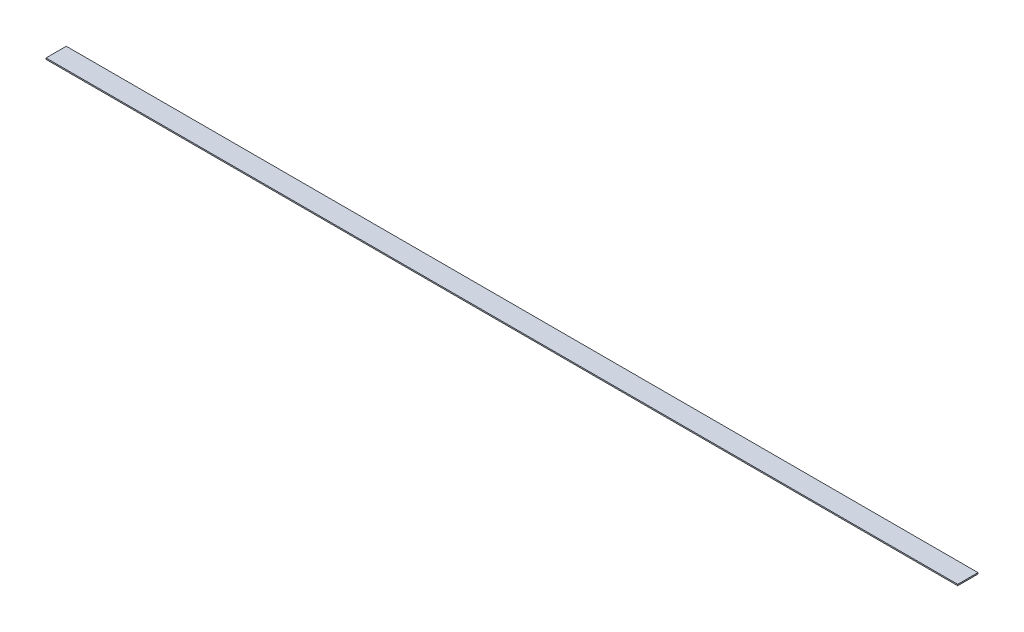
ISO-10303-21;
HEADER;
FILE_DESCRIPTION(('STEP AP214'),'2;1');
FILE_NAME('part.step','',(''),(''),'','','');
FILE_SCHEMA(('AUTOMOTIVE_DESIGN { 1 0 10303 214 1 1 1 1 }'));
ENDSEC;
DATA;
#1=APPLICATION_CONTEXT('core data for automotive mechanical design processes');
#2=APPLICATION_PROTOCOL_DEFINITION('international standard','automotive_design',2000,#1);
#3=PRODUCT_CONTEXT('',#1,'mechanical');
#4=PRODUCT('Part','Part','',(#3));
#5=PRODUCT_RELATED_PRODUCT_CATEGORY('part','',(#4));
#6=PRODUCT_DEFINITION_FORMATION('','',#4);
#7=PRODUCT_DEFINITION_CONTEXT('part definition',#1,'design');
#8=PRODUCT_DEFINITION('design','',#6,#7);
#9=PRODUCT_DEFINITION_SHAPE('','',#8);
#10=(LENGTH_UNIT() NAMED_UNIT(*) SI_UNIT(.MILLI.,.METRE.));
#11=(NAMED_UNIT(*) PLANE_ANGLE_UNIT() SI_UNIT($,.RADIAN.));
#12=(NAMED_UNIT(*) SI_UNIT($,.STERADIAN.) SOLID_ANGLE_UNIT());
#13=UNCERTAINTY_MEASURE_WITH_UNIT(LENGTH_MEASURE(1.E-05),#10,'distance_accuracy_value','');
#14=(GEOMETRIC_REPRESENTATION_CONTEXT(3) GLOBAL_UNCERTAINTY_ASSIGNED_CONTEXT((#13)) GLOBAL_UNIT_ASSIGNED_CONTEXT((#10,
#11,#12)) REPRESENTATION_CONTEXT('',''));
#15=CARTESIAN_POINT('',(0.,0.,0.));
#16=DIRECTION('',(0.,0.,1.));
#17=DIRECTION('',(1.,0.,0.));
#18=AXIS2_PLACEMENT_3D('',#15,#16,#17);
#19=CARTESIAN_POINT('',(-571.5,1.5875,12.7000000000001));
#20=DIRECTION('',(1.,0.,0.));
#21=DIRECTION('',(0.,0.,-1.));
#22=AXIS2_PLACEMENT_3D('',#19,#20,#21);
#23=PLANE('',#22);
#24=DIRECTION('',(0.,0.,1.));
#25=VECTOR('',#24,1.);
#26=CARTESIAN_POINT('',(-571.5,0.,12.7000000000001));
#27=LINE('',#26,#25);
#28=CARTESIAN_POINT('',(-571.5,0.,-12.6999999999999));
#29=VERTEX_POINT('',#28);
#30=CARTESIAN_POINT('',(-571.5,0.,12.7000000000001));
#31=VERTEX_POINT('',#30);
#32=EDGE_CURVE('E98',#29,#31,#27,.T.);
#33=ORIENTED_EDGE('',*,*,#32,.T.);
#34=DIRECTION('',(0.,-1.,0.));
#35=VECTOR('',#34,1.);
#36=CARTESIAN_POINT('',(-571.5,1.5875,12.7000000000001));
#37=LINE('',#36,#35);
#38=CARTESIAN_POINT('',(-571.5,1.5875,12.7000000000001));
#39=VERTEX_POINT('',#38);
#40=EDGE_CURVE('E11',#39,#31,#37,.T.);
#41=ORIENTED_EDGE('',*,*,#40,.F.);
#42=DIRECTION('',(0.,0.,1.));
#43=VECTOR('',#42,1.);
#44=CARTESIAN_POINT('',(-571.5,1.5875,12.7000000000001));
#45=LINE('',#44,#43);
#46=CARTESIAN_POINT('',(-571.5,1.5875,-12.6999999999999));
#47=VERTEX_POINT('',#46);
#48=EDGE_CURVE('E86',#47,#39,#45,.T.);
#49=ORIENTED_EDGE('',*,*,#48,.F.);
#50=DIRECTION('',(0.,-1.,0.));
#51=VECTOR('',#50,1.);
#52=CARTESIAN_POINT('',(-571.5,1.5875,-12.6999999999999));
#53=LINE('',#52,#51);
#54=EDGE_CURVE('E94',#47,#29,#53,.T.);
#55=ORIENTED_EDGE('',*,*,#54,.T.);
#56=EDGE_LOOP('',(#33,#41,#49,#55));
#57=FACE_BOUND('',#56,.T.);
#58=ADVANCED_FACE('F35',(#57),#23,.F.);
#59=CARTESIAN_POINT('',(571.5,1.5875,12.6999999999999));
#60=DIRECTION('',(0.,0.,-1.));
#61=DIRECTION('',(-1.,0.,0.));
#62=AXIS2_PLACEMENT_3D('',#59,#60,#61);
#63=PLANE('',#62);
#64=DIRECTION('',(1.,0.,0.));
#65=VECTOR('',#64,1.);
#66=CARTESIAN_POINT('',(571.5,0.,12.6999999999999));
#67=LINE('',#66,#65);
#68=CARTESIAN_POINT('',(571.5,0.,12.6999999999999));
#69=VERTEX_POINT('',#68);
#70=EDGE_CURVE('E90',#31,#69,#67,.T.);
#71=ORIENTED_EDGE('',*,*,#70,.T.);
#72=DIRECTION('',(0.,-1.,0.));
#73=VECTOR('',#72,1.);
#74=CARTESIAN_POINT('',(571.5,1.5875,12.6999999999999));
#75=LINE('',#74,#73);
#76=CARTESIAN_POINT('',(571.5,1.5875,12.6999999999999));
#77=VERTEX_POINT('',#76);
#78=EDGE_CURVE('E43',#77,#69,#75,.T.);
#79=ORIENTED_EDGE('',*,*,#78,.F.);
#80=DIRECTION('',(1.,0.,0.));
#81=VECTOR('',#80,1.);
#82=CARTESIAN_POINT('',(571.5,1.5875,12.6999999999999));
#83=LINE('',#82,#81);
#84=EDGE_CURVE('E81',#39,#77,#83,.T.);
#85=ORIENTED_EDGE('',*,*,#84,.F.);
#86=ORIENTED_EDGE('',*,*,#40,.T.);
#87=EDGE_LOOP('',(#71,#79,#85,#86));
#88=FACE_BOUND('',#87,.T.);
#89=ADVANCED_FACE('F89',(#88),#63,.F.);
#90=CARTESIAN_POINT('',(571.5,1.5875,12.6999999999999));
#91=DIRECTION('',(-1.,0.,0.));
#92=DIRECTION('',(0.,0.,1.));
#93=AXIS2_PLACEMENT_3D('',#90,#91,#92);
#94=PLANE('',#93);
#95=DIRECTION('',(0.,0.,-1.));
#96=VECTOR('',#95,1.);
#97=CARTESIAN_POINT('',(571.5,0.,12.6999999999999));
#98=LINE('',#97,#96);
#99=CARTESIAN_POINT('',(571.5,0.,-12.7000000000001));
#100=VERTEX_POINT('',#99);
#101=EDGE_CURVE('E68',#69,#100,#98,.T.);
#102=ORIENTED_EDGE('',*,*,#101,.T.);
#103=DIRECTION('',(0.,-1.,0.));
#104=VECTOR('',#103,1.);
#105=CARTESIAN_POINT('',(571.5,1.5875,-12.7000000000001));
#106=LINE('',#105,#104);
#107=CARTESIAN_POINT('',(571.5,1.5875,-12.7000000000001));
#108=VERTEX_POINT('',#107);
#109=EDGE_CURVE('E91',#108,#100,#106,.T.);
#110=ORIENTED_EDGE('',*,*,#109,.F.);
#111=DIRECTION('',(0.,0.,-1.));
#112=VECTOR('',#111,1.);
#113=CARTESIAN_POINT('',(571.5,1.5875,12.6999999999999));
#114=LINE('',#113,#112);
#115=EDGE_CURVE('E84',#77,#108,#114,.T.);
#116=ORIENTED_EDGE('',*,*,#115,.F.);
#117=ORIENTED_EDGE('',*,*,#78,.T.);
#118=EDGE_LOOP('',(#102,#110,#116,#117));
#119=FACE_BOUND('',#118,.T.);
#120=ADVANCED_FACE('F92',(#119),#94,.F.);
#121=CARTESIAN_POINT('',(571.5,1.5875,-12.7000000000001));
#122=DIRECTION('',(0.,0.,1.));
#123=DIRECTION('',(1.,0.,0.));
#124=AXIS2_PLACEMENT_3D('',#121,#122,#123);
#125=PLANE('',#124);
#126=DIRECTION('',(-1.,0.,0.));
#127=VECTOR('',#126,1.);
#128=CARTESIAN_POINT('',(571.5,0.,-12.7000000000001));
#129=LINE('',#128,#127);
#130=EDGE_CURVE('E74',#100,#29,#129,.T.);
#131=ORIENTED_EDGE('',*,*,#130,.T.);
#132=ORIENTED_EDGE('',*,*,#54,.F.);
#133=DIRECTION('',(-1.,0.,0.));
#134=VECTOR('',#133,1.);
#135=CARTESIAN_POINT('',(571.5,1.5875,-12.7000000000001));
#136=LINE('',#135,#134);
#137=EDGE_CURVE('E51',#108,#47,#136,.T.);
#138=ORIENTED_EDGE('',*,*,#137,.F.);
#139=ORIENTED_EDGE('',*,*,#109,.T.);
#140=EDGE_LOOP('',(#131,#132,#138,#139));
#141=FACE_BOUND('',#140,.T.);
#142=ADVANCED_FACE('F105',(#141),#125,.F.);
#143=CARTESIAN_POINT('',(0.,1.5875,0.));
#144=DIRECTION('',(0.,1.,0.));
#145=DIRECTION('',(0.,0.,1.));
#146=AXIS2_PLACEMENT_3D('',#143,#144,#145);
#147=PLANE('',#146);
#148=ORIENTED_EDGE('',*,*,#48,.T.);
#149=ORIENTED_EDGE('',*,*,#84,.T.);
#150=ORIENTED_EDGE('',*,*,#115,.T.);
#151=ORIENTED_EDGE('',*,*,#137,.T.);
#152=EDGE_LOOP('',(#148,#149,#150,#151));
#153=FACE_BOUND('',#152,.T.);
#154=ADVANCED_FACE('F82',(#153),#147,.T.);
#155=CARTESIAN_POINT('',(0.,0.,0.));
#156=DIRECTION('',(0.,1.,0.));
#157=DIRECTION('',(0.,0.,1.));
#158=AXIS2_PLACEMENT_3D('',#155,#156,#157);
#159=PLANE('',#158);
#160=ORIENTED_EDGE('',*,*,#32,.F.);
#161=ORIENTED_EDGE('',*,*,#130,.F.);
#162=ORIENTED_EDGE('',*,*,#101,.F.);
#163=ORIENTED_EDGE('',*,*,#70,.F.);
#164=EDGE_LOOP('',(#160,#161,#162,#163));
#165=FACE_BOUND('',#164,.T.);
#166=ADVANCED_FACE('F108',(#165),#159,.F.);
#167=CLOSED_SHELL('',(#58,#89,#120,#142,#154,#166));
#168=MANIFOLD_SOLID_BREP('B2',#167);
#169=ADVANCED_BREP_SHAPE_REPRESENTATION('',(#18,#168),#14);
#170=SHAPE_DEFINITION_REPRESENTATION(#9,#169);
ENDSEC;
END-ISO-10303-21;
